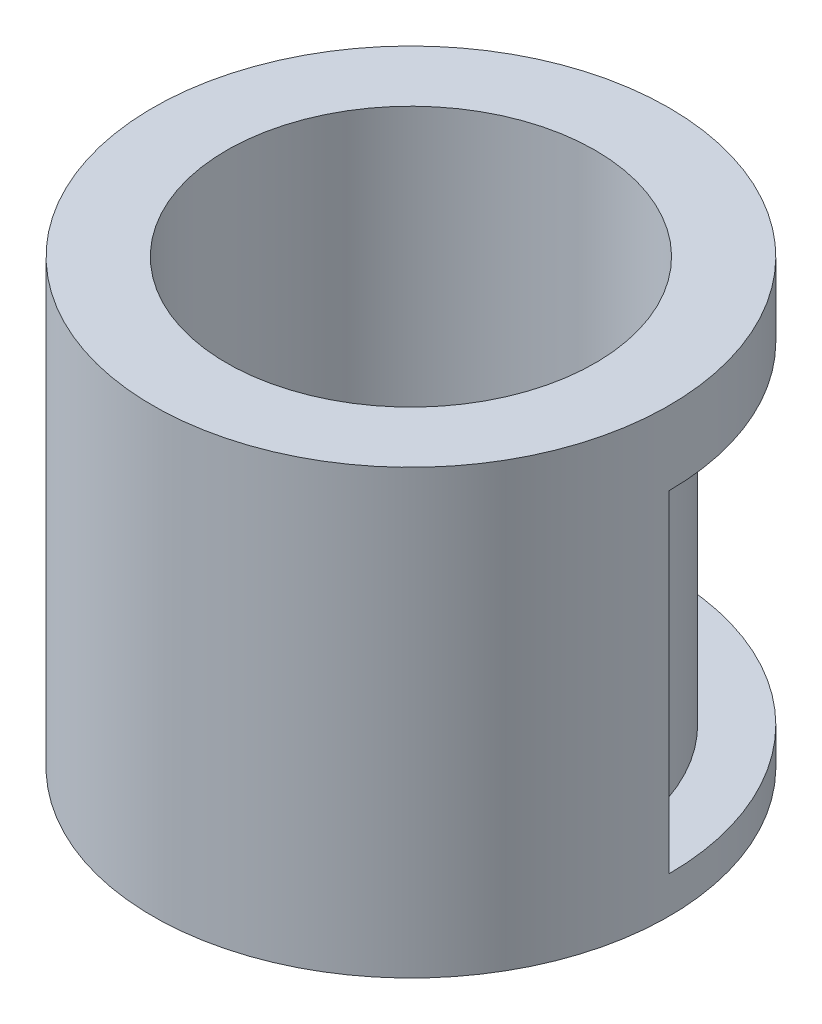
ISO-10303-21;
HEADER;
FILE_DESCRIPTION(('STEP AP214'),'2;1');
FILE_NAME('part.step','',(''),(''),'','','');
FILE_SCHEMA(('AUTOMOTIVE_DESIGN { 1 0 10303 214 1 1 1 1 }'));
ENDSEC;
DATA;
#1=APPLICATION_CONTEXT('core data for automotive mechanical design processes');
#2=APPLICATION_PROTOCOL_DEFINITION('international standard','automotive_design',2000,#1);
#3=PRODUCT_CONTEXT('',#1,'mechanical');
#4=PRODUCT('Part','Part','',(#3));
#5=PRODUCT_RELATED_PRODUCT_CATEGORY('part','',(#4));
#6=PRODUCT_DEFINITION_FORMATION('','',#4);
#7=PRODUCT_DEFINITION_CONTEXT('part definition',#1,'design');
#8=PRODUCT_DEFINITION('design','',#6,#7);
#9=PRODUCT_DEFINITION_SHAPE('','',#8);
#10=(LENGTH_UNIT() NAMED_UNIT(*) SI_UNIT(.MILLI.,.METRE.));
#11=(NAMED_UNIT(*) PLANE_ANGLE_UNIT() SI_UNIT($,.RADIAN.));
#12=(NAMED_UNIT(*) SI_UNIT($,.STERADIAN.) SOLID_ANGLE_UNIT());
#13=UNCERTAINTY_MEASURE_WITH_UNIT(LENGTH_MEASURE(1.E-05),#10,'distance_accuracy_value','');
#14=(GEOMETRIC_REPRESENTATION_CONTEXT(3) GLOBAL_UNCERTAINTY_ASSIGNED_CONTEXT((#13)) GLOBAL_UNIT_ASSIGNED_CONTEXT((#10,
#11,#12)) REPRESENTATION_CONTEXT('',''));
#15=CARTESIAN_POINT('',(0.,0.,0.));
#16=DIRECTION('',(0.,0.,1.));
#17=DIRECTION('',(1.,0.,0.));
#18=AXIS2_PLACEMENT_3D('',#15,#16,#17);
#19=CARTESIAN_POINT('',(0.,0.,0.));
#20=DIRECTION('',(0.,-1.,0.));
#21=DIRECTION('',(0.,0.,-1.));
#22=AXIS2_PLACEMENT_3D('',#19,#20,#21);
#23=CYLINDRICAL_SURFACE('',#22,88.9);
#24=DIRECTION('',(0.,1.,0.));
#25=VECTOR('',#24,1.);
#26=CARTESIAN_POINT('',(-44.4500000000004,127.,-76.9896583964364));
#27=LINE('',#26,#25);
#28=CARTESIAN_POINT('',(-44.4500000000004,12.7,-76.9896583964364));
#29=VERTEX_POINT('',#28);
#30=CARTESIAN_POINT('',(-44.4500000000004,127.,-76.9896583964364));
#31=VERTEX_POINT('',#30);
#32=EDGE_CURVE('E90',#29,#31,#27,.T.);
#33=ORIENTED_EDGE('',*,*,#32,.F.);
#34=CARTESIAN_POINT('',(0.,12.7,0.));
#35=DIRECTION('',(0.,-1.,0.));
#36=DIRECTION('',(0.,0.,-1.));
#37=AXIS2_PLACEMENT_3D('',#34,#35,#36);
#38=CIRCLE('',#37,88.9);
#39=CARTESIAN_POINT('',(88.9,12.7,0.));
#40=VERTEX_POINT('',#39);
#41=EDGE_CURVE('E85',#29,#40,#38,.T.);
#42=ORIENTED_EDGE('',*,*,#41,.T.);
#43=DIRECTION('',(0.,1.,0.));
#44=VECTOR('',#43,1.);
#45=CARTESIAN_POINT('',(88.9,127.,0.));
#46=LINE('',#45,#44);
#47=CARTESIAN_POINT('',(88.9,127.,0.));
#48=VERTEX_POINT('',#47);
#49=EDGE_CURVE('E74',#40,#48,#46,.T.);
#50=ORIENTED_EDGE('',*,*,#49,.T.);
#51=CARTESIAN_POINT('',(0.,127.,0.));
#52=DIRECTION('',(0.,-1.,0.));
#53=DIRECTION('',(0.,0.,-1.));
#54=AXIS2_PLACEMENT_3D('',#51,#52,#53);
#55=CIRCLE('',#54,88.9);
#56=EDGE_CURVE('E91',#31,#48,#55,.T.);
#57=ORIENTED_EDGE('',*,*,#56,.F.);
#58=EDGE_LOOP('',(#33,#42,#50,#57));
#59=FACE_BOUND('',#58,.T.);
#60=CARTESIAN_POINT('',(0.,152.4,0.));
#61=DIRECTION('',(0.,-1.,0.));
#62=DIRECTION('',(0.,0.,-1.));
#63=AXIS2_PLACEMENT_3D('',#60,#61,#62);
#64=CIRCLE('',#63,88.9);
#65=CARTESIAN_POINT('',(0.,152.4,-88.9));
#66=VERTEX_POINT('',#65);
#67=EDGE_CURVE('E11',#66,#66,#64,.T.);
#68=ORIENTED_EDGE('',*,*,#67,.T.);
#69=EDGE_LOOP('',(#68));
#70=FACE_BOUND('',#69,.T.);
#71=CARTESIAN_POINT('',(0.,0.,0.));
#72=DIRECTION('',(0.,-1.,0.));
#73=DIRECTION('',(0.,0.,-1.));
#74=AXIS2_PLACEMENT_3D('',#71,#72,#73);
#75=CIRCLE('',#74,88.9);
#76=CARTESIAN_POINT('',(0.,0.,-88.9));
#77=VERTEX_POINT('',#76);
#78=EDGE_CURVE('E102',#77,#77,#75,.T.);
#79=ORIENTED_EDGE('',*,*,#78,.F.);
#80=EDGE_LOOP('',(#79));
#81=FACE_BOUND('',#80,.T.);
#82=ADVANCED_FACE('F33',(#59,#70,#81),#23,.T.);
#83=CARTESIAN_POINT('',(63.5,152.4,0.));
#84=DIRECTION('',(0.,1.,0.));
#85=DIRECTION('',(0.,0.,1.));
#86=AXIS2_PLACEMENT_3D('',#83,#84,#85);
#87=PLANE('',#86);
#88=CARTESIAN_POINT('',(0.,152.4,0.));
#89=DIRECTION('',(0.,-1.,0.));
#90=DIRECTION('',(0.,0.,-1.));
#91=AXIS2_PLACEMENT_3D('',#88,#89,#90);
#92=CIRCLE('',#91,63.5);
#93=CARTESIAN_POINT('',(0.,152.4,-63.5));
#94=VERTEX_POINT('',#93);
#95=EDGE_CURVE('E40',#94,#94,#92,.T.);
#96=ORIENTED_EDGE('',*,*,#95,.T.);
#97=EDGE_LOOP('',(#96));
#98=FACE_BOUND('',#97,.T.);
#99=ORIENTED_EDGE('',*,*,#67,.F.);
#100=EDGE_LOOP('',(#99));
#101=FACE_BOUND('',#100,.T.);
#102=ADVANCED_FACE('F110',(#98,#101),#87,.T.);
#103=CARTESIAN_POINT('',(0.,0.,0.));
#104=DIRECTION('',(0.,-1.,0.));
#105=DIRECTION('',(0.,0.,-1.));
#106=AXIS2_PLACEMENT_3D('',#103,#104,#105);
#107=CYLINDRICAL_SURFACE('',#106,63.5);
#108=CARTESIAN_POINT('',(0.,0.,0.));
#109=DIRECTION('',(0.,-1.,0.));
#110=DIRECTION('',(0.,0.,-1.));
#111=AXIS2_PLACEMENT_3D('',#108,#109,#110);
#112=CIRCLE('',#111,63.5);
#113=CARTESIAN_POINT('',(0.,0.,-63.5));
#114=VERTEX_POINT('',#113);
#115=EDGE_CURVE('E105',#114,#114,#112,.T.);
#116=ORIENTED_EDGE('',*,*,#115,.T.);
#117=EDGE_LOOP('',(#116));
#118=FACE_BOUND('',#117,.T.);
#119=ORIENTED_EDGE('',*,*,#95,.F.);
#120=EDGE_LOOP('',(#119));
#121=FACE_BOUND('',#120,.T.);
#122=ADVANCED_FACE('F113',(#118,#121),#107,.F.);
#123=CARTESIAN_POINT('',(63.5,0.,0.));
#124=DIRECTION('',(0.,-1.,0.));
#125=DIRECTION('',(0.,0.,-1.));
#126=AXIS2_PLACEMENT_3D('',#123,#124,#125);
#127=PLANE('',#126);
#128=ORIENTED_EDGE('',*,*,#78,.T.);
#129=EDGE_LOOP('',(#128));
#130=FACE_BOUND('',#129,.T.);
#131=ORIENTED_EDGE('',*,*,#115,.F.);
#132=EDGE_LOOP('',(#131));
#133=FACE_BOUND('',#132,.T.);
#134=ADVANCED_FACE('F115',(#130,#133),#127,.T.);
#135=CARTESIAN_POINT('',(-44.4500000000004,12.7,-76.9896583964364));
#136=DIRECTION('',(0.,-1.,0.));
#137=DIRECTION('',(0.,0.,-1.));
#138=AXIS2_PLACEMENT_3D('',#135,#136,#137);
#139=PLANE('',#138);
#140=CARTESIAN_POINT('',(0.,12.7,0.));
#141=DIRECTION('',(0.,-1.,0.));
#142=DIRECTION('',(0.,0.,-1.));
#143=AXIS2_PLACEMENT_3D('',#140,#141,#142);
#144=CIRCLE('',#143,69.85);
#145=CARTESIAN_POINT('',(-34.9250000000003,12.7,-60.4918744543429));
#146=VERTEX_POINT('',#145);
#147=CARTESIAN_POINT('',(69.85,12.7,0.));
#148=VERTEX_POINT('',#147);
#149=EDGE_CURVE('E55',#146,#148,#144,.T.);
#150=ORIENTED_EDGE('',*,*,#149,.T.);
#151=DIRECTION('',(1.,0.,0.));
#152=VECTOR('',#151,1.);
#153=CARTESIAN_POINT('',(88.9,12.7,0.));
#154=LINE('',#153,#152);
#155=EDGE_CURVE('E77',#148,#40,#154,.T.);
#156=ORIENTED_EDGE('',*,*,#155,.T.);
#157=ORIENTED_EDGE('',*,*,#41,.F.);
#158=DIRECTION('',(-0.500000000000004,0.,-0.866025403784436));
#159=VECTOR('',#158,1.);
#160=CARTESIAN_POINT('',(-44.4500000000004,12.7,-76.9896583964364));
#161=LINE('',#160,#159);
#162=EDGE_CURVE('E190',#146,#29,#161,.T.);
#163=ORIENTED_EDGE('',*,*,#162,.F.);
#164=EDGE_LOOP('',(#150,#156,#157,#163));
#165=FACE_BOUND('',#164,.T.);
#166=ADVANCED_FACE('F83',(#165),#139,.F.);
#167=CARTESIAN_POINT('',(0.,0.,0.));
#168=DIRECTION('',(0.,-1.,0.));
#169=DIRECTION('',(0.,0.,-1.));
#170=AXIS2_PLACEMENT_3D('',#167,#168,#169);
#171=CYLINDRICAL_SURFACE('',#170,69.85);
#172=CARTESIAN_POINT('',(0.,127.,0.));
#173=DIRECTION('',(0.,-1.,0.));
#174=DIRECTION('',(0.,0.,-1.));
#175=AXIS2_PLACEMENT_3D('',#172,#173,#174);
#176=CIRCLE('',#175,69.85);
#177=CARTESIAN_POINT('',(-34.9250000000003,127.,-60.4918744543429));
#178=VERTEX_POINT('',#177);
#179=CARTESIAN_POINT('',(69.85,127.,0.));
#180=VERTEX_POINT('',#179);
#181=EDGE_CURVE('E94',#178,#180,#176,.T.);
#182=ORIENTED_EDGE('',*,*,#181,.T.);
#183=DIRECTION('',(0.,-1.,0.));
#184=VECTOR('',#183,1.);
#185=CARTESIAN_POINT('',(69.85,12.7,0.));
#186=LINE('',#185,#184);
#187=EDGE_CURVE('E193',#180,#148,#186,.T.);
#188=ORIENTED_EDGE('',*,*,#187,.T.);
#189=ORIENTED_EDGE('',*,*,#149,.F.);
#190=DIRECTION('',(0.,-1.,0.));
#191=VECTOR('',#190,1.);
#192=CARTESIAN_POINT('',(-34.9250000000003,12.7,-60.4918744543429));
#193=LINE('',#192,#191);
#194=EDGE_CURVE('E92',#178,#146,#193,.T.);
#195=ORIENTED_EDGE('',*,*,#194,.F.);
#196=EDGE_LOOP('',(#182,#188,#189,#195));
#197=FACE_BOUND('',#196,.T.);
#198=ADVANCED_FACE('F150',(#197),#171,.T.);
#199=CARTESIAN_POINT('',(-34.9250000000003,127.,-60.4918744543429));
#200=DIRECTION('',(0.,1.,0.));
#201=DIRECTION('',(0.,0.,1.));
#202=AXIS2_PLACEMENT_3D('',#199,#200,#201);
#203=PLANE('',#202);
#204=ORIENTED_EDGE('',*,*,#56,.T.);
#205=DIRECTION('',(-1.,0.,0.));
#206=VECTOR('',#205,1.);
#207=CARTESIAN_POINT('',(69.85,127.,0.));
#208=LINE('',#207,#206);
#209=EDGE_CURVE('E47',#48,#180,#208,.T.);
#210=ORIENTED_EDGE('',*,*,#209,.T.);
#211=ORIENTED_EDGE('',*,*,#181,.F.);
#212=DIRECTION('',(0.500000000000004,0.,0.866025403784436));
#213=VECTOR('',#212,1.);
#214=CARTESIAN_POINT('',(-34.9250000000003,127.,-60.4918744543429));
#215=LINE('',#214,#213);
#216=EDGE_CURVE('E96',#31,#178,#215,.T.);
#217=ORIENTED_EDGE('',*,*,#216,.F.);
#218=EDGE_LOOP('',(#204,#210,#211,#217));
#219=FACE_BOUND('',#218,.T.);
#220=ADVANCED_FACE('F156',(#219),#203,.F.);
#221=CARTESIAN_POINT('',(0.,0.,0.));
#222=DIRECTION('',(-0.866025403784436,0.,0.500000000000004));
#223=DIRECTION('',(0.500000000000004,0.,0.866025403784436));
#224=AXIS2_PLACEMENT_3D('',#221,#222,#223);
#225=PLANE('',#224);
#226=ORIENTED_EDGE('',*,*,#162,.T.);
#227=ORIENTED_EDGE('',*,*,#32,.T.);
#228=ORIENTED_EDGE('',*,*,#216,.T.);
#229=ORIENTED_EDGE('',*,*,#194,.T.);
#230=EDGE_LOOP('',(#226,#227,#228,#229));
#231=FACE_BOUND('',#230,.T.);
#232=ADVANCED_FACE('F163',(#231),#225,.F.);
#233=CARTESIAN_POINT('',(0.,0.,0.));
#234=DIRECTION('',(0.,0.,-1.));
#235=DIRECTION('',(-1.,0.,0.));
#236=AXIS2_PLACEMENT_3D('',#233,#234,#235);
#237=PLANE('',#236);
#238=ORIENTED_EDGE('',*,*,#155,.F.);
#239=ORIENTED_EDGE('',*,*,#187,.F.);
#240=ORIENTED_EDGE('',*,*,#209,.F.);
#241=ORIENTED_EDGE('',*,*,#49,.F.);
#242=EDGE_LOOP('',(#238,#239,#240,#241));
#243=FACE_BOUND('',#242,.T.);
#244=ADVANCED_FACE('F76',(#243),#237,.T.);
#245=CLOSED_SHELL('',(#82,#102,#122,#134,#166,#198,#220,#232,#244));
#246=MANIFOLD_SOLID_BREP('B2',#245);
#247=ADVANCED_BREP_SHAPE_REPRESENTATION('',(#18,#246),#14);
#248=SHAPE_DEFINITION_REPRESENTATION(#9,#247);
ENDSEC;
END-ISO-10303-21;
